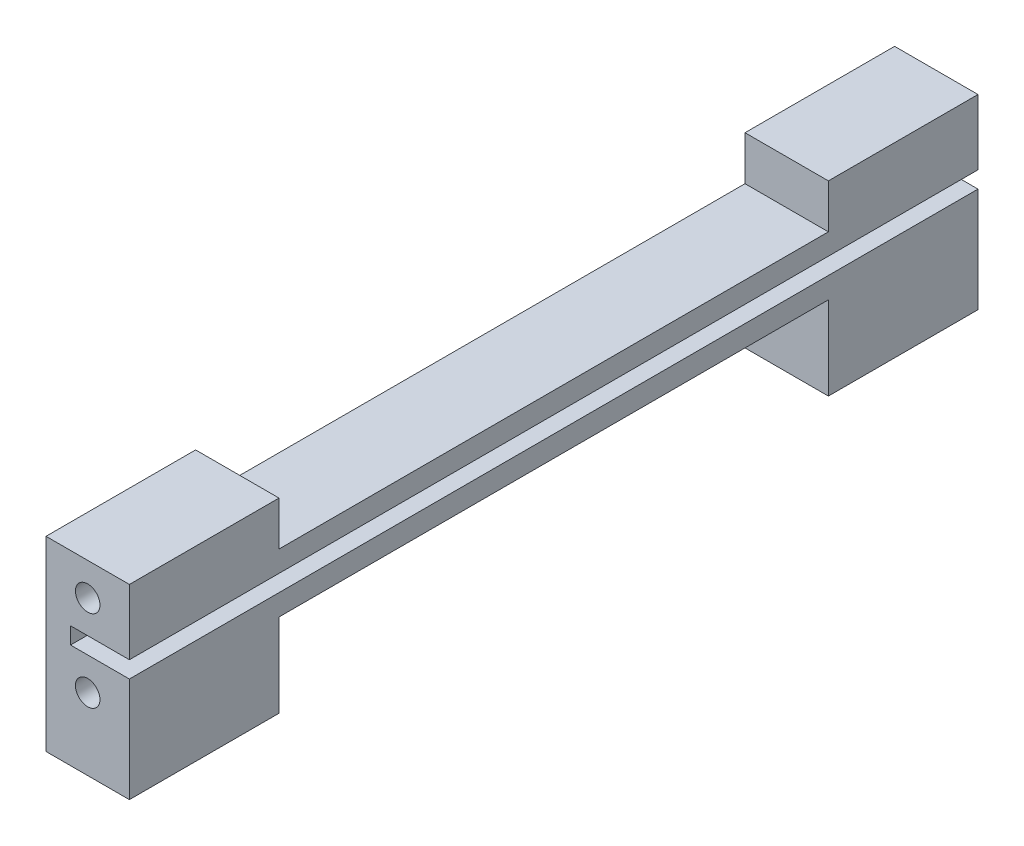
ISO-10303-21;
HEADER;
FILE_DESCRIPTION(('STEP AP214'),'2;1');
FILE_NAME('part.step','',(''),(''),'','','');
FILE_SCHEMA(('AUTOMOTIVE_DESIGN { 1 0 10303 214 1 1 1 1 }'));
ENDSEC;
DATA;
#1=APPLICATION_CONTEXT('core data for automotive mechanical design processes');
#2=APPLICATION_PROTOCOL_DEFINITION('international standard','automotive_design',2000,#1);
#3=PRODUCT_CONTEXT('',#1,'mechanical');
#4=PRODUCT('Part','Part','',(#3));
#5=PRODUCT_RELATED_PRODUCT_CATEGORY('part','',(#4));
#6=PRODUCT_DEFINITION_FORMATION('','',#4);
#7=PRODUCT_DEFINITION_CONTEXT('part definition',#1,'design');
#8=PRODUCT_DEFINITION('design','',#6,#7);
#9=PRODUCT_DEFINITION_SHAPE('','',#8);
#10=(LENGTH_UNIT() NAMED_UNIT(*) SI_UNIT(.MILLI.,.METRE.));
#11=(NAMED_UNIT(*) PLANE_ANGLE_UNIT() SI_UNIT($,.RADIAN.));
#12=(NAMED_UNIT(*) SI_UNIT($,.STERADIAN.) SOLID_ANGLE_UNIT());
#13=UNCERTAINTY_MEASURE_WITH_UNIT(LENGTH_MEASURE(1.E-05),#10,'distance_accuracy_value','');
#14=(GEOMETRIC_REPRESENTATION_CONTEXT(3) GLOBAL_UNCERTAINTY_ASSIGNED_CONTEXT((#13)) GLOBAL_UNIT_ASSIGNED_CONTEXT((#10,
#11,#12)) REPRESENTATION_CONTEXT('',''));
#15=CARTESIAN_POINT('',(0.,0.,0.));
#16=DIRECTION('',(0.,0.,1.));
#17=DIRECTION('',(1.,0.,0.));
#18=AXIS2_PLACEMENT_3D('',#15,#16,#17);
#19=CARTESIAN_POINT('',(8.5,15.,0.));
#20=DIRECTION('',(0.,0.,-1.));
#21=DIRECTION('',(0.,1.,0.));
#22=AXIS2_PLACEMENT_3D('',#19,#20,#21);
#23=PLANE('',#22);
#24=CARTESIAN_POINT('',(4.25,3.325,0.));
#25=DIRECTION('',(0.,0.,1.));
#26=DIRECTION('',(1.,0.,0.));
#27=AXIS2_PLACEMENT_3D('',#24,#25,#26);
#28=CIRCLE('',#27,1.24999999999999);
#29=CARTESIAN_POINT('',(5.49999999999999,3.325,0.));
#30=VERTEX_POINT('',#29);
#31=EDGE_CURVE('E303',#30,#30,#28,.T.);
#32=ORIENTED_EDGE('',*,*,#31,.F.);
#33=EDGE_LOOP('',(#32));
#34=FACE_BOUND('',#33,.T.);
#35=CARTESIAN_POINT('',(4.25,11.675,0.));
#36=DIRECTION('',(0.,0.,1.));
#37=DIRECTION('',(1.,0.,0.));
#38=AXIS2_PLACEMENT_3D('',#35,#36,#37);
#39=CIRCLE('',#38,1.24999999999999);
#40=CARTESIAN_POINT('',(5.49999999999999,11.675,0.));
#41=VERTEX_POINT('',#40);
#42=EDGE_CURVE('E295',#41,#41,#39,.T.);
#43=ORIENTED_EDGE('',*,*,#42,.F.);
#44=EDGE_LOOP('',(#43));
#45=FACE_BOUND('',#44,.T.);
#46=DIRECTION('',(-1.,0.,0.));
#47=VECTOR('',#46,1.);
#48=CARTESIAN_POINT('',(8.5,6.65,0.));
#49=LINE('',#48,#47);
#50=CARTESIAN_POINT('',(8.5,6.65,0.));
#51=VERTEX_POINT('',#50);
#52=CARTESIAN_POINT('',(2.5,6.65,0.));
#53=VERTEX_POINT('',#52);
#54=EDGE_CURVE('E279',#51,#53,#49,.T.);
#55=ORIENTED_EDGE('',*,*,#54,.T.);
#56=DIRECTION('',(0.,1.,0.));
#57=VECTOR('',#56,1.);
#58=CARTESIAN_POINT('',(2.5,6.65,0.));
#59=LINE('',#58,#57);
#60=CARTESIAN_POINT('',(2.5,8.35,0.));
#61=VERTEX_POINT('',#60);
#62=EDGE_CURVE('E276',#53,#61,#59,.T.);
#63=ORIENTED_EDGE('',*,*,#62,.T.);
#64=DIRECTION('',(1.,0.,0.));
#65=VECTOR('',#64,1.);
#66=CARTESIAN_POINT('',(2.5,8.35,0.));
#67=LINE('',#66,#65);
#68=CARTESIAN_POINT('',(8.5,8.35,0.));
#69=VERTEX_POINT('',#68);
#70=EDGE_CURVE('E243',#61,#69,#67,.T.);
#71=ORIENTED_EDGE('',*,*,#70,.T.);
#72=DIRECTION('',(0.,-1.,0.));
#73=VECTOR('',#72,1.);
#74=CARTESIAN_POINT('',(8.5,15.,0.));
#75=LINE('',#74,#73);
#76=CARTESIAN_POINT('',(8.5,15.,0.));
#77=VERTEX_POINT('',#76);
#78=EDGE_CURVE('E240',#77,#69,#75,.T.);
#79=ORIENTED_EDGE('',*,*,#78,.F.);
#80=DIRECTION('',(-1.,0.,0.));
#81=VECTOR('',#80,1.);
#82=CARTESIAN_POINT('',(8.5,15.,0.));
#83=LINE('',#82,#81);
#84=CARTESIAN_POINT('',(0.,15.,0.));
#85=VERTEX_POINT('',#84);
#86=EDGE_CURVE('E207',#77,#85,#83,.T.);
#87=ORIENTED_EDGE('',*,*,#86,.T.);
#88=DIRECTION('',(0.,-1.,0.));
#89=VECTOR('',#88,1.);
#90=CARTESIAN_POINT('',(0.,15.,0.));
#91=LINE('',#90,#89);
#92=CARTESIAN_POINT('',(0.,-4.,0.));
#93=VERTEX_POINT('',#92);
#94=EDGE_CURVE('E183',#85,#93,#91,.T.);
#95=ORIENTED_EDGE('',*,*,#94,.T.);
#96=DIRECTION('',(-1.,0.,0.));
#97=VECTOR('',#96,1.);
#98=CARTESIAN_POINT('',(0.,-4.,0.));
#99=LINE('',#98,#97);
#100=CARTESIAN_POINT('',(8.5,-4.,0.));
#101=VERTEX_POINT('',#100);
#102=EDGE_CURVE('E323',#101,#93,#99,.T.);
#103=ORIENTED_EDGE('',*,*,#102,.F.);
#104=EDGE_CURVE('E245',#51,#101,#75,.T.);
#105=ORIENTED_EDGE('',*,*,#104,.F.);
#106=EDGE_LOOP('',(#55,#63,#71,#79,#87,#95,#103,#105));
#107=FACE_BOUND('',#106,.T.);
#108=ADVANCED_FACE('F39',(#34,#45,#107),#23,.F.);
#109=CARTESIAN_POINT('',(8.5,0.,-86.5));
#110=DIRECTION('',(0.,0.,1.));
#111=DIRECTION('',(0.,-1.,0.));
#112=AXIS2_PLACEMENT_3D('',#109,#110,#111);
#113=PLANE('',#112);
#114=CARTESIAN_POINT('',(4.25,3.32499999999998,-86.5));
#115=DIRECTION('',(0.,0.,-1.));
#116=DIRECTION('',(0.,1.,0.));
#117=AXIS2_PLACEMENT_3D('',#114,#115,#116);
#118=CIRCLE('',#117,1.24999999999999);
#119=CARTESIAN_POINT('',(4.25,4.57499999999997,-86.5));
#120=VERTEX_POINT('',#119);
#121=EDGE_CURVE('E319',#120,#120,#118,.T.);
#122=ORIENTED_EDGE('',*,*,#121,.F.);
#123=EDGE_LOOP('',(#122));
#124=FACE_BOUND('',#123,.T.);
#125=CARTESIAN_POINT('',(4.25,11.675,-86.5));
#126=DIRECTION('',(0.,0.,-1.));
#127=DIRECTION('',(0.,1.,0.));
#128=AXIS2_PLACEMENT_3D('',#125,#126,#127);
#129=CIRCLE('',#128,1.24999999999999);
#130=CARTESIAN_POINT('',(4.25,12.925,-86.5));
#131=VERTEX_POINT('',#130);
#132=EDGE_CURVE('E311',#131,#131,#129,.T.);
#133=ORIENTED_EDGE('',*,*,#132,.F.);
#134=EDGE_LOOP('',(#133));
#135=FACE_BOUND('',#134,.T.);
#136=DIRECTION('',(-1.,0.,0.));
#137=VECTOR('',#136,1.);
#138=CARTESIAN_POINT('',(8.5,6.65,-86.5));
#139=LINE('',#138,#137);
#140=CARTESIAN_POINT('',(8.5,6.65,-86.5));
#141=VERTEX_POINT('',#140);
#142=CARTESIAN_POINT('',(2.5,6.65,-86.5));
#143=VERTEX_POINT('',#142);
#144=EDGE_CURVE('E275',#141,#143,#139,.T.);
#145=ORIENTED_EDGE('',*,*,#144,.F.);
#146=DIRECTION('',(0.,1.,0.));
#147=VECTOR('',#146,1.);
#148=CARTESIAN_POINT('',(8.5,0.,-86.5));
#149=LINE('',#148,#147);
#150=CARTESIAN_POINT('',(8.5,-4.,-86.5));
#151=VERTEX_POINT('',#150);
#152=EDGE_CURVE('E160',#151,#141,#149,.T.);
#153=ORIENTED_EDGE('',*,*,#152,.F.);
#154=DIRECTION('',(1.,0.,0.));
#155=VECTOR('',#154,1.);
#156=CARTESIAN_POINT('',(0.,-4.,-86.5));
#157=LINE('',#156,#155);
#158=CARTESIAN_POINT('',(0.,-4.,-86.5));
#159=VERTEX_POINT('',#158);
#160=EDGE_CURVE('E343',#159,#151,#157,.T.);
#161=ORIENTED_EDGE('',*,*,#160,.F.);
#162=DIRECTION('',(0.,1.,0.));
#163=VECTOR('',#162,1.);
#164=CARTESIAN_POINT('',(0.,0.,-86.5));
#165=LINE('',#164,#163);
#166=CARTESIAN_POINT('',(0.,15.,-86.5));
#167=VERTEX_POINT('',#166);
#168=EDGE_CURVE('E195',#159,#167,#165,.T.);
#169=ORIENTED_EDGE('',*,*,#168,.T.);
#170=DIRECTION('',(-1.,0.,0.));
#171=VECTOR('',#170,1.);
#172=CARTESIAN_POINT('',(8.5,15.,-86.5));
#173=LINE('',#172,#171);
#174=CARTESIAN_POINT('',(8.5,15.,-86.5));
#175=VERTEX_POINT('',#174);
#176=EDGE_CURVE('E150',#175,#167,#173,.T.);
#177=ORIENTED_EDGE('',*,*,#176,.F.);
#178=CARTESIAN_POINT('',(8.5,8.35,-86.5));
#179=VERTEX_POINT('',#178);
#180=EDGE_CURVE('E157',#179,#175,#149,.T.);
#181=ORIENTED_EDGE('',*,*,#180,.F.);
#182=DIRECTION('',(1.,0.,0.));
#183=VECTOR('',#182,1.);
#184=CARTESIAN_POINT('',(2.5,8.35,-86.5));
#185=LINE('',#184,#183);
#186=CARTESIAN_POINT('',(2.5,8.35,-86.5));
#187=VERTEX_POINT('',#186);
#188=EDGE_CURVE('E55',#187,#179,#185,.T.);
#189=ORIENTED_EDGE('',*,*,#188,.F.);
#190=DIRECTION('',(0.,1.,0.));
#191=VECTOR('',#190,1.);
#192=CARTESIAN_POINT('',(2.5,6.65,-86.5));
#193=LINE('',#192,#191);
#194=EDGE_CURVE('E285',#143,#187,#193,.T.);
#195=ORIENTED_EDGE('',*,*,#194,.F.);
#196=EDGE_LOOP('',(#145,#153,#161,#169,#177,#181,#189,#195));
#197=FACE_BOUND('',#196,.T.);
#198=ADVANCED_FACE('F402',(#124,#135,#197),#113,.F.);
#199=CARTESIAN_POINT('',(8.5,0.,0.));
#200=DIRECTION('',(-1.,0.,0.));
#201=DIRECTION('',(0.,0.,1.));
#202=AXIS2_PLACEMENT_3D('',#199,#200,#201);
#203=PLANE('',#202);
#204=DIRECTION('',(0.,0.,1.));
#205=VECTOR('',#204,1.);
#206=CARTESIAN_POINT('',(8.5,6.65,-86.5));
#207=LINE('',#206,#205);
#208=EDGE_CURVE('E174',#141,#51,#207,.T.);
#209=ORIENTED_EDGE('',*,*,#208,.T.);
#210=ORIENTED_EDGE('',*,*,#104,.T.);
#211=DIRECTION('',(0.,0.,1.));
#212=VECTOR('',#211,1.);
#213=CARTESIAN_POINT('',(8.5,-4.,0.));
#214=LINE('',#213,#212);
#215=CARTESIAN_POINT('',(8.5,-4.,-15.25));
#216=VERTEX_POINT('',#215);
#217=EDGE_CURVE('E326',#216,#101,#214,.T.);
#218=ORIENTED_EDGE('',*,*,#217,.F.);
#219=DIRECTION('',(0.,1.,0.));
#220=VECTOR('',#219,1.);
#221=CARTESIAN_POINT('',(8.5,0.,-15.25));
#222=LINE('',#221,#220);
#223=CARTESIAN_POINT('',(8.5,4.5,-15.25));
#224=VERTEX_POINT('',#223);
#225=EDGE_CURVE('E134',#216,#224,#222,.T.);
#226=ORIENTED_EDGE('',*,*,#225,.T.);
#227=DIRECTION('',(0.,0.,-1.));
#228=VECTOR('',#227,1.);
#229=CARTESIAN_POINT('',(8.5,4.5,-15.25));
#230=LINE('',#229,#228);
#231=CARTESIAN_POINT('',(8.5,4.5,-71.25));
#232=VERTEX_POINT('',#231);
#233=EDGE_CURVE('E123',#224,#232,#230,.T.);
#234=ORIENTED_EDGE('',*,*,#233,.T.);
#235=DIRECTION('',(0.,-1.,0.));
#236=VECTOR('',#235,1.);
#237=CARTESIAN_POINT('',(8.5,4.5,-71.25));
#238=LINE('',#237,#236);
#239=CARTESIAN_POINT('',(8.5,-4.,-71.25));
#240=VERTEX_POINT('',#239);
#241=EDGE_CURVE('E130',#232,#240,#238,.T.);
#242=ORIENTED_EDGE('',*,*,#241,.T.);
#243=DIRECTION('',(0.,0.,1.));
#244=VECTOR('',#243,1.);
#245=CARTESIAN_POINT('',(8.5,-4.,-86.5));
#246=LINE('',#245,#244);
#247=EDGE_CURVE('E340',#151,#240,#246,.T.);
#248=ORIENTED_EDGE('',*,*,#247,.F.);
#249=ORIENTED_EDGE('',*,*,#152,.T.);
#250=EDGE_LOOP('',(#209,#210,#218,#226,#234,#242,#248,#249));
#251=FACE_BOUND('',#250,.T.);
#252=ADVANCED_FACE('F126',(#251),#203,.F.);
#253=DIRECTION('',(0.,0.,1.));
#254=VECTOR('',#253,1.);
#255=CARTESIAN_POINT('',(8.5,8.35,-86.5));
#256=LINE('',#255,#254);
#257=EDGE_CURVE('E270',#179,#69,#256,.T.);
#258=ORIENTED_EDGE('',*,*,#257,.F.);
#259=ORIENTED_EDGE('',*,*,#180,.T.);
#260=DIRECTION('',(0.,0.,1.));
#261=VECTOR('',#260,1.);
#262=CARTESIAN_POINT('',(8.5,15.,-86.5));
#263=LINE('',#262,#261);
#264=CARTESIAN_POINT('',(8.5,15.,-71.25));
#265=VERTEX_POINT('',#264);
#266=EDGE_CURVE('E64',#175,#265,#263,.T.);
#267=ORIENTED_EDGE('',*,*,#266,.T.);
#268=DIRECTION('',(0.,-1.,0.));
#269=VECTOR('',#268,1.);
#270=CARTESIAN_POINT('',(8.5,15.,-71.25));
#271=LINE('',#270,#269);
#272=CARTESIAN_POINT('',(8.5,10.5,-71.25));
#273=VERTEX_POINT('',#272);
#274=EDGE_CURVE('E200',#265,#273,#271,.T.);
#275=ORIENTED_EDGE('',*,*,#274,.T.);
#276=DIRECTION('',(0.,0.,1.));
#277=VECTOR('',#276,1.);
#278=CARTESIAN_POINT('',(8.5,10.5,-71.25));
#279=LINE('',#278,#277);
#280=CARTESIAN_POINT('',(8.5,10.5,-15.25));
#281=VERTEX_POINT('',#280);
#282=EDGE_CURVE('E105',#273,#281,#279,.T.);
#283=ORIENTED_EDGE('',*,*,#282,.T.);
#284=DIRECTION('',(0.,1.,0.));
#285=VECTOR('',#284,1.);
#286=CARTESIAN_POINT('',(8.5,10.5,-15.25));
#287=LINE('',#286,#285);
#288=CARTESIAN_POINT('',(8.5,15.,-15.25));
#289=VERTEX_POINT('',#288);
#290=EDGE_CURVE('E221',#281,#289,#287,.T.);
#291=ORIENTED_EDGE('',*,*,#290,.T.);
#292=DIRECTION('',(0.,0.,1.));
#293=VECTOR('',#292,1.);
#294=CARTESIAN_POINT('',(8.5,15.,-15.25));
#295=LINE('',#294,#293);
#296=EDGE_CURVE('E250',#289,#77,#295,.T.);
#297=ORIENTED_EDGE('',*,*,#296,.T.);
#298=ORIENTED_EDGE('',*,*,#78,.T.);
#299=EDGE_LOOP('',(#258,#259,#267,#275,#283,#291,#297,#298));
#300=FACE_BOUND('',#299,.T.);
#301=ADVANCED_FACE('F398',(#300),#203,.F.);
#302=CARTESIAN_POINT('',(8.5,15.,-71.25));
#303=DIRECTION('',(0.,0.,-1.));
#304=DIRECTION('',(-1.,0.,0.));
#305=AXIS2_PLACEMENT_3D('',#302,#303,#304);
#306=PLANE('',#305);
#307=DIRECTION('',(0.,-1.,0.));
#308=VECTOR('',#307,1.);
#309=CARTESIAN_POINT('',(0.,15.,-71.25));
#310=LINE('',#309,#308);
#311=CARTESIAN_POINT('',(0.,15.,-71.25));
#312=VERTEX_POINT('',#311);
#313=CARTESIAN_POINT('',(0.,10.5,-71.25));
#314=VERTEX_POINT('',#313);
#315=EDGE_CURVE('E169',#312,#314,#310,.T.);
#316=ORIENTED_EDGE('',*,*,#315,.T.);
#317=DIRECTION('',(-1.,0.,0.));
#318=VECTOR('',#317,1.);
#319=CARTESIAN_POINT('',(8.5,10.5,-71.25));
#320=LINE('',#319,#318);
#321=EDGE_CURVE('E11',#273,#314,#320,.T.);
#322=ORIENTED_EDGE('',*,*,#321,.F.);
#323=ORIENTED_EDGE('',*,*,#274,.F.);
#324=DIRECTION('',(-1.,0.,0.));
#325=VECTOR('',#324,1.);
#326=CARTESIAN_POINT('',(8.5,15.,-71.25));
#327=LINE('',#326,#325);
#328=EDGE_CURVE('E168',#265,#312,#327,.T.);
#329=ORIENTED_EDGE('',*,*,#328,.T.);
#330=EDGE_LOOP('',(#316,#322,#323,#329));
#331=FACE_BOUND('',#330,.T.);
#332=ADVANCED_FACE('F41',(#331),#306,.F.);
#333=CARTESIAN_POINT('',(8.5,10.5,-71.25));
#334=DIRECTION('',(0.,-1.,0.));
#335=DIRECTION('',(0.,0.,-1.));
#336=AXIS2_PLACEMENT_3D('',#333,#334,#335);
#337=PLANE('',#336);
#338=DIRECTION('',(0.,0.,1.));
#339=VECTOR('',#338,1.);
#340=CARTESIAN_POINT('',(0.,10.5,-71.25));
#341=LINE('',#340,#339);
#342=CARTESIAN_POINT('',(0.,10.5,-15.25));
#343=VERTEX_POINT('',#342);
#344=EDGE_CURVE('E173',#314,#343,#341,.T.);
#345=ORIENTED_EDGE('',*,*,#344,.T.);
#346=DIRECTION('',(-1.,0.,0.));
#347=VECTOR('',#346,1.);
#348=CARTESIAN_POINT('',(8.5,10.5,-15.25));
#349=LINE('',#348,#347);
#350=EDGE_CURVE('E48',#281,#343,#349,.T.);
#351=ORIENTED_EDGE('',*,*,#350,.F.);
#352=ORIENTED_EDGE('',*,*,#282,.F.);
#353=ORIENTED_EDGE('',*,*,#321,.T.);
#354=EDGE_LOOP('',(#345,#351,#352,#353));
#355=FACE_BOUND('',#354,.T.);
#356=ADVANCED_FACE('F408',(#355),#337,.F.);
#357=CARTESIAN_POINT('',(8.5,10.5,-15.25));
#358=DIRECTION('',(0.,0.,1.));
#359=DIRECTION('',(0.,-1.,0.));
#360=AXIS2_PLACEMENT_3D('',#357,#358,#359);
#361=PLANE('',#360);
#362=DIRECTION('',(0.,1.,0.));
#363=VECTOR('',#362,1.);
#364=CARTESIAN_POINT('',(0.,10.5,-15.25));
#365=LINE('',#364,#363);
#366=CARTESIAN_POINT('',(0.,15.,-15.25));
#367=VERTEX_POINT('',#366);
#368=EDGE_CURVE('E177',#343,#367,#365,.T.);
#369=ORIENTED_EDGE('',*,*,#368,.T.);
#370=DIRECTION('',(-1.,0.,0.));
#371=VECTOR('',#370,1.);
#372=CARTESIAN_POINT('',(8.5,15.,-15.25));
#373=LINE('',#372,#371);
#374=EDGE_CURVE('E211',#289,#367,#373,.T.);
#375=ORIENTED_EDGE('',*,*,#374,.F.);
#376=ORIENTED_EDGE('',*,*,#290,.F.);
#377=ORIENTED_EDGE('',*,*,#350,.T.);
#378=EDGE_LOOP('',(#369,#375,#376,#377));
#379=FACE_BOUND('',#378,.T.);
#380=ADVANCED_FACE('F219',(#379),#361,.F.);
#381=CARTESIAN_POINT('',(8.5,15.,-15.25));
#382=DIRECTION('',(0.,-1.,0.));
#383=DIRECTION('',(0.,0.,-1.));
#384=AXIS2_PLACEMENT_3D('',#381,#382,#383);
#385=PLANE('',#384);
#386=DIRECTION('',(0.,0.,1.));
#387=VECTOR('',#386,1.);
#388=CARTESIAN_POINT('',(0.,15.,-15.25));
#389=LINE('',#388,#387);
#390=EDGE_CURVE('E180',#367,#85,#389,.T.);
#391=ORIENTED_EDGE('',*,*,#390,.T.);
#392=ORIENTED_EDGE('',*,*,#86,.F.);
#393=ORIENTED_EDGE('',*,*,#296,.F.);
#394=ORIENTED_EDGE('',*,*,#374,.T.);
#395=EDGE_LOOP('',(#391,#392,#393,#394));
#396=FACE_BOUND('',#395,.T.);
#397=ADVANCED_FACE('F230',(#396),#385,.F.);
#398=CARTESIAN_POINT('',(8.5,0.,-15.25));
#399=DIRECTION('',(0.,0.,1.));
#400=DIRECTION('',(1.,0.,0.));
#401=AXIS2_PLACEMENT_3D('',#398,#399,#400);
#402=PLANE('',#401);
#403=DIRECTION('',(0.,1.,0.));
#404=VECTOR('',#403,1.);
#405=CARTESIAN_POINT('',(0.,0.,-15.25));
#406=LINE('',#405,#404);
#407=CARTESIAN_POINT('',(0.,-4.,-15.25));
#408=VERTEX_POINT('',#407);
#409=CARTESIAN_POINT('',(0.,4.5,-15.25));
#410=VERTEX_POINT('',#409);
#411=EDGE_CURVE('E187',#408,#410,#406,.T.);
#412=ORIENTED_EDGE('',*,*,#411,.T.);
#413=DIRECTION('',(-1.,0.,0.));
#414=VECTOR('',#413,1.);
#415=CARTESIAN_POINT('',(8.5,4.5,-15.25));
#416=LINE('',#415,#414);
#417=EDGE_CURVE('E149',#224,#410,#416,.T.);
#418=ORIENTED_EDGE('',*,*,#417,.F.);
#419=ORIENTED_EDGE('',*,*,#225,.F.);
#420=DIRECTION('',(1.,0.,0.));
#421=VECTOR('',#420,1.);
#422=CARTESIAN_POINT('',(0.,-4.,-15.25));
#423=LINE('',#422,#421);
#424=EDGE_CURVE('E330',#408,#216,#423,.T.);
#425=ORIENTED_EDGE('',*,*,#424,.F.);
#426=EDGE_LOOP('',(#412,#418,#419,#425));
#427=FACE_BOUND('',#426,.T.);
#428=ADVANCED_FACE('F428',(#427),#402,.F.);
#429=CARTESIAN_POINT('',(8.5,4.5,-15.25));
#430=DIRECTION('',(0.,1.,0.));
#431=DIRECTION('',(0.,0.,1.));
#432=AXIS2_PLACEMENT_3D('',#429,#430,#431);
#433=PLANE('',#432);
#434=DIRECTION('',(0.,0.,-1.));
#435=VECTOR('',#434,1.);
#436=CARTESIAN_POINT('',(0.,4.5,-15.25));
#437=LINE('',#436,#435);
#438=CARTESIAN_POINT('',(0.,4.5,-71.25));
#439=VERTEX_POINT('',#438);
#440=EDGE_CURVE('E144',#410,#439,#437,.T.);
#441=ORIENTED_EDGE('',*,*,#440,.T.);
#442=DIRECTION('',(-1.,0.,0.));
#443=VECTOR('',#442,1.);
#444=CARTESIAN_POINT('',(8.5,4.5,-71.25));
#445=LINE('',#444,#443);
#446=EDGE_CURVE('E141',#232,#439,#445,.T.);
#447=ORIENTED_EDGE('',*,*,#446,.F.);
#448=ORIENTED_EDGE('',*,*,#233,.F.);
#449=ORIENTED_EDGE('',*,*,#417,.T.);
#450=EDGE_LOOP('',(#441,#447,#448,#449));
#451=FACE_BOUND('',#450,.T.);
#452=ADVANCED_FACE('F142',(#451),#433,.F.);
#453=CARTESIAN_POINT('',(8.5,4.5,-71.25));
#454=DIRECTION('',(0.,0.,-1.));
#455=DIRECTION('',(-1.,0.,0.));
#456=AXIS2_PLACEMENT_3D('',#453,#454,#455);
#457=PLANE('',#456);
#458=DIRECTION('',(0.,-1.,0.));
#459=VECTOR('',#458,1.);
#460=CARTESIAN_POINT('',(0.,4.5,-71.25));
#461=LINE('',#460,#459);
#462=CARTESIAN_POINT('',(0.,-4.,-71.25));
#463=VERTEX_POINT('',#462);
#464=EDGE_CURVE('E192',#439,#463,#461,.T.);
#465=ORIENTED_EDGE('',*,*,#464,.T.);
#466=DIRECTION('',(-1.,0.,0.));
#467=VECTOR('',#466,1.);
#468=CARTESIAN_POINT('',(0.,-4.,-71.25));
#469=LINE('',#468,#467);
#470=EDGE_CURVE('E155',#240,#463,#469,.T.);
#471=ORIENTED_EDGE('',*,*,#470,.F.);
#472=ORIENTED_EDGE('',*,*,#241,.F.);
#473=ORIENTED_EDGE('',*,*,#446,.T.);
#474=EDGE_LOOP('',(#465,#471,#472,#473));
#475=FACE_BOUND('',#474,.T.);
#476=ADVANCED_FACE('F153',(#475),#457,.F.);
#477=CARTESIAN_POINT('',(8.5,15.,-86.5));
#478=DIRECTION('',(0.,-1.,0.));
#479=DIRECTION('',(0.,0.,-1.));
#480=AXIS2_PLACEMENT_3D('',#477,#478,#479);
#481=PLANE('',#480);
#482=DIRECTION('',(0.,0.,1.));
#483=VECTOR('',#482,1.);
#484=CARTESIAN_POINT('',(0.,15.,-86.5));
#485=LINE('',#484,#483);
#486=EDGE_CURVE('E97',#167,#312,#485,.T.);
#487=ORIENTED_EDGE('',*,*,#486,.T.);
#488=ORIENTED_EDGE('',*,*,#328,.F.);
#489=ORIENTED_EDGE('',*,*,#266,.F.);
#490=ORIENTED_EDGE('',*,*,#176,.T.);
#491=EDGE_LOOP('',(#487,#488,#489,#490));
#492=FACE_BOUND('',#491,.T.);
#493=ADVANCED_FACE('F404',(#492),#481,.F.);
#494=CARTESIAN_POINT('',(0.,0.,0.));
#495=DIRECTION('',(-1.,0.,0.));
#496=DIRECTION('',(0.,0.,1.));
#497=AXIS2_PLACEMENT_3D('',#494,#495,#496);
#498=PLANE('',#497);
#499=ORIENTED_EDGE('',*,*,#315,.F.);
#500=ORIENTED_EDGE('',*,*,#486,.F.);
#501=ORIENTED_EDGE('',*,*,#168,.F.);
#502=DIRECTION('',(0.,0.,-1.));
#503=VECTOR('',#502,1.);
#504=CARTESIAN_POINT('',(0.,-4.,-86.5));
#505=LINE('',#504,#503);
#506=EDGE_CURVE('E347',#463,#159,#505,.T.);
#507=ORIENTED_EDGE('',*,*,#506,.F.);
#508=ORIENTED_EDGE('',*,*,#464,.F.);
#509=ORIENTED_EDGE('',*,*,#440,.F.);
#510=ORIENTED_EDGE('',*,*,#411,.F.);
#511=DIRECTION('',(0.,0.,-1.));
#512=VECTOR('',#511,1.);
#513=CARTESIAN_POINT('',(0.,-4.,0.));
#514=LINE('',#513,#512);
#515=EDGE_CURVE('E334',#93,#408,#514,.T.);
#516=ORIENTED_EDGE('',*,*,#515,.F.);
#517=ORIENTED_EDGE('',*,*,#94,.F.);
#518=ORIENTED_EDGE('',*,*,#390,.F.);
#519=ORIENTED_EDGE('',*,*,#368,.F.);
#520=ORIENTED_EDGE('',*,*,#344,.F.);
#521=EDGE_LOOP('',(#499,#500,#501,#507,#508,#509,#510,#516,#517,#518,#519,#520));
#522=FACE_BOUND('',#521,.T.);
#523=ADVANCED_FACE('F225',(#522),#498,.T.);
#524=CARTESIAN_POINT('',(8.5,6.65,-86.5));
#525=DIRECTION('',(0.,1.,0.));
#526=DIRECTION('',(0.,0.,1.));
#527=AXIS2_PLACEMENT_3D('',#524,#525,#526);
#528=PLANE('',#527);
#529=ORIENTED_EDGE('',*,*,#54,.F.);
#530=ORIENTED_EDGE('',*,*,#208,.F.);
#531=ORIENTED_EDGE('',*,*,#144,.T.);
#532=DIRECTION('',(0.,0.,1.));
#533=VECTOR('',#532,1.);
#534=CARTESIAN_POINT('',(2.5,6.65,-86.5));
#535=LINE('',#534,#533);
#536=EDGE_CURVE('E262',#143,#53,#535,.T.);
#537=ORIENTED_EDGE('',*,*,#536,.T.);
#538=EDGE_LOOP('',(#529,#530,#531,#537));
#539=FACE_BOUND('',#538,.T.);
#540=ADVANCED_FACE('F446',(#539),#528,.T.);
#541=CARTESIAN_POINT('',(2.5,6.65,-86.5));
#542=DIRECTION('',(1.,0.,0.));
#543=DIRECTION('',(0.,0.,-1.));
#544=AXIS2_PLACEMENT_3D('',#541,#542,#543);
#545=PLANE('',#544);
#546=ORIENTED_EDGE('',*,*,#62,.F.);
#547=ORIENTED_EDGE('',*,*,#536,.F.);
#548=ORIENTED_EDGE('',*,*,#194,.T.);
#549=DIRECTION('',(0.,0.,1.));
#550=VECTOR('',#549,1.);
#551=CARTESIAN_POINT('',(2.5,8.35,-86.5));
#552=LINE('',#551,#550);
#553=EDGE_CURVE('E266',#187,#61,#552,.T.);
#554=ORIENTED_EDGE('',*,*,#553,.T.);
#555=EDGE_LOOP('',(#546,#547,#548,#554));
#556=FACE_BOUND('',#555,.T.);
#557=ADVANCED_FACE('F448',(#556),#545,.T.);
#558=CARTESIAN_POINT('',(2.5,8.35,-86.5));
#559=DIRECTION('',(0.,-1.,0.));
#560=DIRECTION('',(0.,0.,-1.));
#561=AXIS2_PLACEMENT_3D('',#558,#559,#560);
#562=PLANE('',#561);
#563=ORIENTED_EDGE('',*,*,#70,.F.);
#564=ORIENTED_EDGE('',*,*,#553,.F.);
#565=ORIENTED_EDGE('',*,*,#188,.T.);
#566=ORIENTED_EDGE('',*,*,#257,.T.);
#567=EDGE_LOOP('',(#563,#564,#565,#566));
#568=FACE_BOUND('',#567,.T.);
#569=ADVANCED_FACE('F396',(#568),#562,.T.);
#570=CARTESIAN_POINT('',(4.25,11.675,-6.));
#571=DIRECTION('',(0.,0.,1.));
#572=DIRECTION('',(1.,0.,0.));
#573=AXIS2_PLACEMENT_3D('',#570,#571,#572);
#574=CONICAL_SURFACE('',#573,1.25,1.02974425867665);
#575=CARTESIAN_POINT('',(4.25,11.675,-6.75107577378445));
#576=VERTEX_POINT('',#575);
#577=VERTEX_LOOP('',#576);
#578=FACE_BOUND('',#577,.T.);
#579=CARTESIAN_POINT('',(4.25,11.675,-6.));
#580=DIRECTION('',(0.,0.,1.));
#581=DIRECTION('',(1.,0.,0.));
#582=AXIS2_PLACEMENT_3D('',#579,#580,#581);
#583=CIRCLE('',#582,1.25);
#584=CARTESIAN_POINT('',(5.5,11.675,-6.));
#585=VERTEX_POINT('',#584);
#586=EDGE_CURVE('E282',#585,#585,#583,.T.);
#587=ORIENTED_EDGE('',*,*,#586,.T.);
#588=EDGE_LOOP('',(#587));
#589=FACE_BOUND('',#588,.T.);
#590=ADVANCED_FACE('F455',(#578,#589),#574,.F.);
#591=CARTESIAN_POINT('',(4.25,11.675,0.));
#592=DIRECTION('',(0.,0.,1.));
#593=DIRECTION('',(1.,0.,0.));
#594=AXIS2_PLACEMENT_3D('',#591,#592,#593);
#595=CYLINDRICAL_SURFACE('',#594,1.24999999999999);
#596=ORIENTED_EDGE('',*,*,#586,.F.);
#597=EDGE_LOOP('',(#596));
#598=FACE_BOUND('',#597,.T.);
#599=ORIENTED_EDGE('',*,*,#42,.T.);
#600=EDGE_LOOP('',(#599));
#601=FACE_BOUND('',#600,.T.);
#602=ADVANCED_FACE('F554',(#598,#601),#595,.F.);
#603=CARTESIAN_POINT('',(4.25,3.325,-6.));
#604=DIRECTION('',(0.,0.,1.));
#605=DIRECTION('',(1.,0.,0.));
#606=AXIS2_PLACEMENT_3D('',#603,#604,#605);
#607=CONICAL_SURFACE('',#606,1.25,1.02974425867665);
#608=CARTESIAN_POINT('',(4.25,3.325,-6.75107577378445));
#609=VERTEX_POINT('',#608);
#610=VERTEX_LOOP('',#609);
#611=FACE_BOUND('',#610,.T.);
#612=CARTESIAN_POINT('',(4.25,3.325,-6.));
#613=DIRECTION('',(0.,0.,1.));
#614=DIRECTION('',(1.,0.,0.));
#615=AXIS2_PLACEMENT_3D('',#612,#613,#614);
#616=CIRCLE('',#615,1.25);
#617=CARTESIAN_POINT('',(5.5,3.325,-6.));
#618=VERTEX_POINT('',#617);
#619=EDGE_CURVE('E299',#618,#618,#616,.T.);
#620=ORIENTED_EDGE('',*,*,#619,.T.);
#621=EDGE_LOOP('',(#620));
#622=FACE_BOUND('',#621,.T.);
#623=ADVANCED_FACE('F562',(#611,#622),#607,.F.);
#624=CARTESIAN_POINT('',(4.25,3.325,0.));
#625=DIRECTION('',(0.,0.,1.));
#626=DIRECTION('',(1.,0.,0.));
#627=AXIS2_PLACEMENT_3D('',#624,#625,#626);
#628=CYLINDRICAL_SURFACE('',#627,1.24999999999999);
#629=ORIENTED_EDGE('',*,*,#619,.F.);
#630=EDGE_LOOP('',(#629));
#631=FACE_BOUND('',#630,.T.);
#632=ORIENTED_EDGE('',*,*,#31,.T.);
#633=EDGE_LOOP('',(#632));
#634=FACE_BOUND('',#633,.T.);
#635=ADVANCED_FACE('F571',(#631,#634),#628,.F.);
#636=CARTESIAN_POINT('',(4.25,11.675,-80.5));
#637=DIRECTION('',(0.,0.,-1.));
#638=DIRECTION('',(0.,1.,0.));
#639=AXIS2_PLACEMENT_3D('',#636,#637,#638);
#640=CONICAL_SURFACE('',#639,1.25,1.02974425867666);
#641=CARTESIAN_POINT('',(4.25,11.675,-79.7489242262156));
#642=VERTEX_POINT('',#641);
#643=VERTEX_LOOP('',#642);
#644=FACE_BOUND('',#643,.T.);
#645=CARTESIAN_POINT('',(4.25,11.675,-80.5));
#646=DIRECTION('',(0.,0.,-1.));
#647=DIRECTION('',(0.,1.,0.));
#648=AXIS2_PLACEMENT_3D('',#645,#646,#647);
#649=CIRCLE('',#648,1.25);
#650=CARTESIAN_POINT('',(4.25,12.925,-80.5));
#651=VERTEX_POINT('',#650);
#652=EDGE_CURVE('E307',#651,#651,#649,.T.);
#653=ORIENTED_EDGE('',*,*,#652,.T.);
#654=EDGE_LOOP('',(#653));
#655=FACE_BOUND('',#654,.T.);
#656=ADVANCED_FACE('F580',(#644,#655),#640,.F.);
#657=CARTESIAN_POINT('',(4.25,11.675,-86.5));
#658=DIRECTION('',(0.,0.,-1.));
#659=DIRECTION('',(0.,1.,0.));
#660=AXIS2_PLACEMENT_3D('',#657,#658,#659);
#661=CYLINDRICAL_SURFACE('',#660,1.24999999999999);
#662=ORIENTED_EDGE('',*,*,#652,.F.);
#663=EDGE_LOOP('',(#662));
#664=FACE_BOUND('',#663,.T.);
#665=ORIENTED_EDGE('',*,*,#132,.T.);
#666=EDGE_LOOP('',(#665));
#667=FACE_BOUND('',#666,.T.);
#668=ADVANCED_FACE('F589',(#664,#667),#661,.F.);
#669=CARTESIAN_POINT('',(4.25,3.32499999999998,-80.5));
#670=DIRECTION('',(0.,0.,-1.));
#671=DIRECTION('',(0.,1.,0.));
#672=AXIS2_PLACEMENT_3D('',#669,#670,#671);
#673=CONICAL_SURFACE('',#672,1.25,1.02974425867666);
#674=CARTESIAN_POINT('',(4.25,3.32499999999998,-79.7489242262156));
#675=VERTEX_POINT('',#674);
#676=VERTEX_LOOP('',#675);
#677=FACE_BOUND('',#676,.T.);
#678=CARTESIAN_POINT('',(4.25,3.32499999999998,-80.5));
#679=DIRECTION('',(0.,0.,-1.));
#680=DIRECTION('',(0.,1.,0.));
#681=AXIS2_PLACEMENT_3D('',#678,#679,#680);
#682=CIRCLE('',#681,1.25);
#683=CARTESIAN_POINT('',(4.25,4.57499999999998,-80.5));
#684=VERTEX_POINT('',#683);
#685=EDGE_CURVE('E315',#684,#684,#682,.T.);
#686=ORIENTED_EDGE('',*,*,#685,.T.);
#687=EDGE_LOOP('',(#686));
#688=FACE_BOUND('',#687,.T.);
#689=ADVANCED_FACE('F598',(#677,#688),#673,.F.);
#690=CARTESIAN_POINT('',(4.25,3.32499999999998,-86.5));
#691=DIRECTION('',(0.,0.,-1.));
#692=DIRECTION('',(0.,1.,0.));
#693=AXIS2_PLACEMENT_3D('',#690,#691,#692);
#694=CYLINDRICAL_SURFACE('',#693,1.24999999999999);
#695=ORIENTED_EDGE('',*,*,#685,.F.);
#696=EDGE_LOOP('',(#695));
#697=FACE_BOUND('',#696,.T.);
#698=ORIENTED_EDGE('',*,*,#121,.T.);
#699=EDGE_LOOP('',(#698));
#700=FACE_BOUND('',#699,.T.);
#701=ADVANCED_FACE('F479',(#697,#700),#694,.F.);
#702=CARTESIAN_POINT('',(0.,-4.,0.));
#703=DIRECTION('',(0.,-1.,0.));
#704=DIRECTION('',(0.,0.,-1.));
#705=AXIS2_PLACEMENT_3D('',#702,#703,#704);
#706=PLANE('',#705);
#707=ORIENTED_EDGE('',*,*,#515,.T.);
#708=ORIENTED_EDGE('',*,*,#424,.T.);
#709=ORIENTED_EDGE('',*,*,#217,.T.);
#710=ORIENTED_EDGE('',*,*,#102,.T.);
#711=EDGE_LOOP('',(#707,#708,#709,#710));
#712=FACE_BOUND('',#711,.T.);
#713=ADVANCED_FACE('F442',(#712),#706,.T.);
#714=CARTESIAN_POINT('',(0.,-4.,0.));
#715=DIRECTION('',(0.,1.,0.));
#716=DIRECTION('',(0.,0.,1.));
#717=AXIS2_PLACEMENT_3D('',#714,#715,#716);
#718=PLANE('',#717);
#719=ORIENTED_EDGE('',*,*,#506,.T.);
#720=ORIENTED_EDGE('',*,*,#160,.T.);
#721=ORIENTED_EDGE('',*,*,#247,.T.);
#722=ORIENTED_EDGE('',*,*,#470,.T.);
#723=EDGE_LOOP('',(#719,#720,#721,#722));
#724=FACE_BOUND('',#723,.T.);
#725=ADVANCED_FACE('F353',(#724),#718,.F.);
#726=CLOSED_SHELL('',(#108,#198,#252,#301,#332,#356,#380,#397,#428,#452,#476,#493,#523,#540,
#557,#569,#590,#602,#623,#635,#656,#668,#689,#701,#713,#725));
#727=MANIFOLD_SOLID_BREP('B2',#726);
#728=ADVANCED_BREP_SHAPE_REPRESENTATION('',(#18,#727),#14);
#729=SHAPE_DEFINITION_REPRESENTATION(#9,#728);
ENDSEC;
END-ISO-10303-21;
